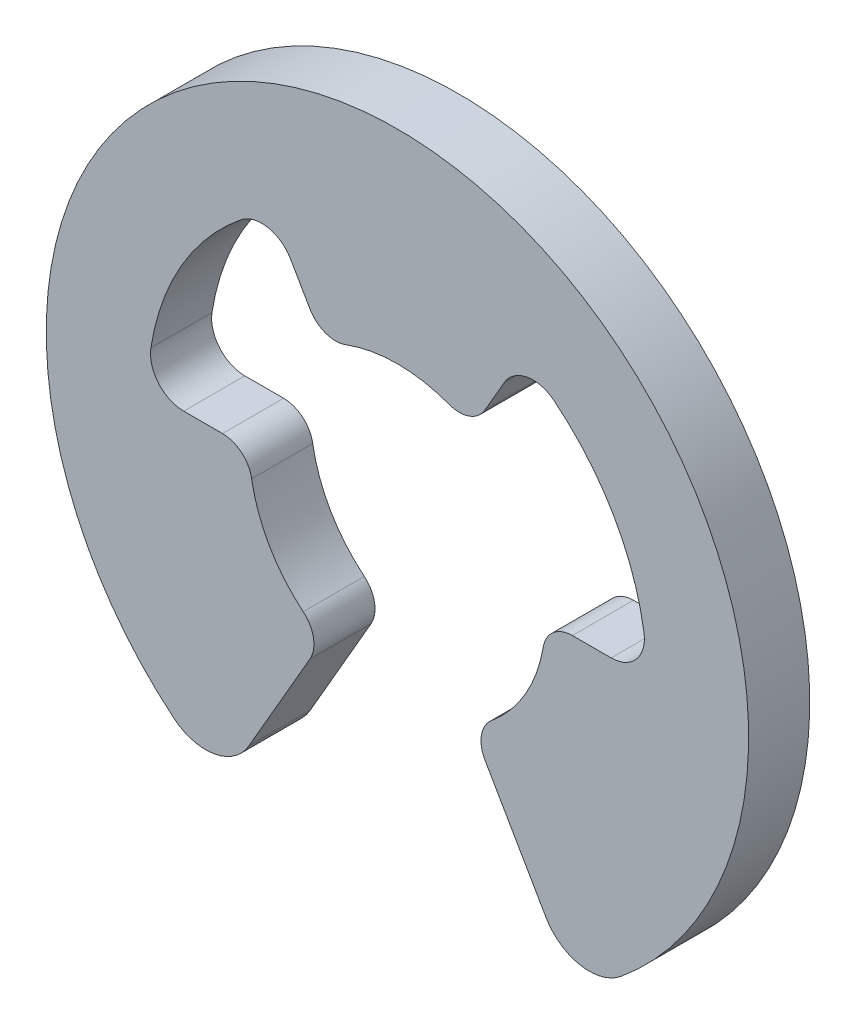
ISO-10303-21;
HEADER;
FILE_DESCRIPTION(('STEP AP214'),'2;1');
FILE_NAME('part.step','',(''),(''),'','','');
FILE_SCHEMA(('AUTOMOTIVE_DESIGN { 1 0 10303 214 1 1 1 1 }'));
ENDSEC;
DATA;
#1=APPLICATION_CONTEXT('core data for automotive mechanical design processes');
#2=APPLICATION_PROTOCOL_DEFINITION('international standard','automotive_design',2000,#1);
#3=PRODUCT_CONTEXT('',#1,'mechanical');
#4=PRODUCT('Part','Part','',(#3));
#5=PRODUCT_RELATED_PRODUCT_CATEGORY('part','',(#4));
#6=PRODUCT_DEFINITION_FORMATION('','',#4);
#7=PRODUCT_DEFINITION_CONTEXT('part definition',#1,'design');
#8=PRODUCT_DEFINITION('design','',#6,#7);
#9=PRODUCT_DEFINITION_SHAPE('','',#8);
#10=(LENGTH_UNIT() NAMED_UNIT(*) SI_UNIT(.MILLI.,.METRE.));
#11=(NAMED_UNIT(*) PLANE_ANGLE_UNIT() SI_UNIT($,.RADIAN.));
#12=(NAMED_UNIT(*) SI_UNIT($,.STERADIAN.) SOLID_ANGLE_UNIT());
#13=UNCERTAINTY_MEASURE_WITH_UNIT(LENGTH_MEASURE(1.E-05),#10,'distance_accuracy_value','');
#14=(GEOMETRIC_REPRESENTATION_CONTEXT(3) GLOBAL_UNCERTAINTY_ASSIGNED_CONTEXT((#13)) GLOBAL_UNIT_ASSIGNED_CONTEXT((#10,
#11,#12)) REPRESENTATION_CONTEXT('',''));
#15=CARTESIAN_POINT('',(0.,0.,0.));
#16=DIRECTION('',(0.,0.,1.));
#17=DIRECTION('',(1.,0.,0.));
#18=AXIS2_PLACEMENT_3D('',#15,#16,#17);
#19=CARTESIAN_POINT('',(3.46765265221274,-4.20148057663333,0.55245));
#20=DIRECTION('',(0.,0.,-1.));
#21=DIRECTION('',(-1.,0.,0.));
#22=AXIS2_PLACEMENT_3D('',#19,#20,#21);
#23=CYLINDRICAL_SURFACE('',#22,0.902334999999987);
#24=DIRECTION('',(0.,0.,-1.));
#25=VECTOR('',#24,1.);
#26=CARTESIAN_POINT('',(2.6862076194889,-4.6526480766333,0.55245));
#27=LINE('',#26,#25);
#28=CARTESIAN_POINT('',(2.6862076194889,-4.6526480766333,0.55245));
#29=VERTEX_POINT('',#28);
#30=CARTESIAN_POINT('',(2.6862076194889,-4.6526480766333,-0.55245));
#31=VERTEX_POINT('',#30);
#32=EDGE_CURVE('E212',#29,#31,#27,.T.);
#33=ORIENTED_EDGE('',*,*,#32,.T.);
#34=CARTESIAN_POINT('',(3.46765265221274,-4.20148057663333,-0.55245));
#35=DIRECTION('',(0.,0.,1.));
#36=DIRECTION('',(1.,0.,0.));
#37=AXIS2_PLACEMENT_3D('',#34,#35,#36);
#38=CIRCLE('',#37,0.902334999999987);
#39=CARTESIAN_POINT('',(4.0420243363657,-4.8974012766188,-0.55245));
#40=VERTEX_POINT('',#39);
#41=EDGE_CURVE('E206',#31,#40,#38,.T.);
#42=ORIENTED_EDGE('',*,*,#41,.T.);
#43=DIRECTION('',(0.,0.,-1.));
#44=VECTOR('',#43,1.);
#45=CARTESIAN_POINT('',(4.0420243363657,-4.8974012766188,0.55245));
#46=LINE('',#45,#44);
#47=CARTESIAN_POINT('',(4.0420243363657,-4.8974012766188,0.55245));
#48=VERTEX_POINT('',#47);
#49=EDGE_CURVE('E11',#48,#40,#46,.T.);
#50=ORIENTED_EDGE('',*,*,#49,.F.);
#51=CARTESIAN_POINT('',(3.46765265221274,-4.20148057663333,0.55245));
#52=DIRECTION('',(0.,0.,1.));
#53=DIRECTION('',(1.,0.,0.));
#54=AXIS2_PLACEMENT_3D('',#51,#52,#53);
#55=CIRCLE('',#54,0.902334999999987);
#56=EDGE_CURVE('E278',#29,#48,#55,.T.);
#57=ORIENTED_EDGE('',*,*,#56,.F.);
#58=EDGE_LOOP('',(#33,#42,#50,#57));
#59=FACE_BOUND('',#58,.T.);
#60=ADVANCED_FACE('F34',(#59),#23,.T.);
#61=CARTESIAN_POINT('',(0.,0.,0.55245));
#62=DIRECTION('',(0.,0.,-1.));
#63=DIRECTION('',(-1.,0.,0.));
#64=AXIS2_PLACEMENT_3D('',#61,#62,#63);
#65=CYLINDRICAL_SURFACE('',#64,6.35000000000001);
#66=ORIENTED_EDGE('',*,*,#49,.T.);
#67=CARTESIAN_POINT('',(0.,0.,-0.55245));
#68=DIRECTION('',(0.,0.,1.));
#69=DIRECTION('',(1.,0.,0.));
#70=AXIS2_PLACEMENT_3D('',#67,#68,#69);
#71=CIRCLE('',#70,6.35000000000001);
#72=CARTESIAN_POINT('',(-4.0420243061111,-4.8974013015892,-0.55245));
#73=VERTEX_POINT('',#72);
#74=EDGE_CURVE('E196',#40,#73,#71,.T.);
#75=ORIENTED_EDGE('',*,*,#74,.T.);
#76=DIRECTION('',(0.,0.,-1.));
#77=VECTOR('',#76,1.);
#78=CARTESIAN_POINT('',(-4.0420243061111,-4.8974013015892,0.55245));
#79=LINE('',#78,#77);
#80=CARTESIAN_POINT('',(-4.0420243061111,-4.8974013015892,0.55245));
#81=VERTEX_POINT('',#80);
#82=EDGE_CURVE('E41',#81,#73,#79,.T.);
#83=ORIENTED_EDGE('',*,*,#82,.F.);
#84=CARTESIAN_POINT('',(0.,0.,0.55245));
#85=DIRECTION('',(0.,0.,1.));
#86=DIRECTION('',(1.,0.,0.));
#87=AXIS2_PLACEMENT_3D('',#84,#85,#86);
#88=CIRCLE('',#87,6.35000000000001);
#89=EDGE_CURVE('E197',#48,#81,#88,.T.);
#90=ORIENTED_EDGE('',*,*,#89,.F.);
#91=EDGE_LOOP('',(#66,#75,#83,#90));
#92=FACE_BOUND('',#91,.T.);
#93=ADVANCED_FACE('F194',(#92),#65,.T.);
#94=CARTESIAN_POINT('',(-3.46765265221277,-4.20148057663329,0.55245));
#95=DIRECTION('',(0.,0.,-1.));
#96=DIRECTION('',(-1.,0.,0.));
#97=AXIS2_PLACEMENT_3D('',#94,#95,#96);
#98=CYLINDRICAL_SURFACE('',#97,0.90233500000004);
#99=ORIENTED_EDGE('',*,*,#82,.T.);
#100=CARTESIAN_POINT('',(-3.46765265221277,-4.20148057663329,-0.55245));
#101=DIRECTION('',(0.,0.,1.));
#102=DIRECTION('',(1.,0.,0.));
#103=AXIS2_PLACEMENT_3D('',#100,#101,#102);
#104=CIRCLE('',#103,0.90233500000004);
#105=CARTESIAN_POINT('',(-2.6862076194889,-4.6526480766333,-0.55245));
#106=VERTEX_POINT('',#105);
#107=EDGE_CURVE('E210',#73,#106,#104,.T.);
#108=ORIENTED_EDGE('',*,*,#107,.T.);
#109=DIRECTION('',(0.,0.,-1.));
#110=VECTOR('',#109,1.);
#111=CARTESIAN_POINT('',(-2.6862076194889,-4.6526480766333,0.55245));
#112=LINE('',#111,#110);
#113=CARTESIAN_POINT('',(-2.6862076194889,-4.6526480766333,0.55245));
#114=VERTEX_POINT('',#113);
#115=EDGE_CURVE('E364',#114,#106,#112,.T.);
#116=ORIENTED_EDGE('',*,*,#115,.F.);
#117=CARTESIAN_POINT('',(-3.46765265221277,-4.20148057663329,0.55245));
#118=DIRECTION('',(0.,0.,1.));
#119=DIRECTION('',(1.,0.,0.));
#120=AXIS2_PLACEMENT_3D('',#117,#118,#119);
#121=CIRCLE('',#120,0.90233500000004);
#122=EDGE_CURVE('E281',#81,#114,#121,.T.);
#123=ORIENTED_EDGE('',*,*,#122,.F.);
#124=EDGE_LOOP('',(#99,#108,#116,#123));
#125=FACE_BOUND('',#124,.T.);
#126=ADVANCED_FACE('F367',(#125),#98,.T.);
#127=CARTESIAN_POINT('',(-2.6862076194889,-4.6526480766333,0.55245));
#128=DIRECTION('',(-0.866025403784419,0.500000000000034,0.));
#129=DIRECTION('',(-0.500000000000034,-0.866025403784419,0.));
#130=AXIS2_PLACEMENT_3D('',#127,#128,#129);
#131=PLANE('',#130);
#132=ORIENTED_EDGE('',*,*,#115,.T.);
#133=DIRECTION('',(0.500000000000034,0.866025403784419,0.));
#134=VECTOR('',#133,1.);
#135=CARTESIAN_POINT('',(-2.6862076194889,-4.6526480766333,-0.55245));
#136=LINE('',#135,#134);
#137=CARTESIAN_POINT('',(-1.5815751888149,-2.7393685830178,-0.55245));
#138=VERTEX_POINT('',#137);
#139=EDGE_CURVE('E216',#106,#138,#136,.T.);
#140=ORIENTED_EDGE('',*,*,#139,.T.);
#141=DIRECTION('',(0.,0.,-1.));
#142=VECTOR('',#141,1.);
#143=CARTESIAN_POINT('',(-1.5815751888149,-2.7393685830178,0.55245));
#144=LINE('',#143,#142);
#145=CARTESIAN_POINT('',(-1.5815751888149,-2.7393685830178,0.55245));
#146=VERTEX_POINT('',#145);
#147=EDGE_CURVE('E362',#146,#138,#144,.T.);
#148=ORIENTED_EDGE('',*,*,#147,.F.);
#149=DIRECTION('',(0.500000000000034,0.866025403784419,0.));
#150=VECTOR('',#149,1.);
#151=CARTESIAN_POINT('',(-2.6862076194889,-4.6526480766333,0.55245));
#152=LINE('',#151,#150);
#153=EDGE_CURVE('E283',#114,#146,#152,.T.);
#154=ORIENTED_EDGE('',*,*,#153,.F.);
#155=EDGE_LOOP('',(#132,#140,#148,#154));
#156=FACE_BOUND('',#155,.T.);
#157=ADVANCED_FACE('F375',(#156),#131,.F.);
#158=CARTESIAN_POINT('',(-2.04461299145624,-2.47203358301781,0.55245));
#159=DIRECTION('',(0.,0.,-1.));
#160=DIRECTION('',(-1.,0.,0.));
#161=AXIS2_PLACEMENT_3D('',#158,#159,#160);
#162=CYLINDRICAL_SURFACE('',#161,0.534669999999918);
#163=ORIENTED_EDGE('',*,*,#147,.T.);
#164=CARTESIAN_POINT('',(-2.04461299145624,-2.47203358301781,-0.55245));
#165=DIRECTION('',(0.,0.,1.));
#166=DIRECTION('',(1.,0.,0.));
#167=AXIS2_PLACEMENT_3D('',#164,#165,#166);
#168=CIRCLE('',#167,0.534669999999918);
#169=CARTESIAN_POINT('',(-1.7038441516538,-2.0600279923766,-0.55245));
#170=VERTEX_POINT('',#169);
#171=EDGE_CURVE('E219',#138,#170,#168,.T.);
#172=ORIENTED_EDGE('',*,*,#171,.T.);
#173=DIRECTION('',(0.,0.,-1.));
#174=VECTOR('',#173,1.);
#175=CARTESIAN_POINT('',(-1.7038441516538,-2.0600279923766,0.55245));
#176=LINE('',#175,#174);
#177=CARTESIAN_POINT('',(-1.7038441516538,-2.0600279923766,0.55245));
#178=VERTEX_POINT('',#177);
#179=EDGE_CURVE('E360',#178,#170,#176,.T.);
#180=ORIENTED_EDGE('',*,*,#179,.F.);
#181=CARTESIAN_POINT('',(-2.04461299145624,-2.47203358301781,0.55245));
#182=DIRECTION('',(0.,0.,1.));
#183=DIRECTION('',(1.,0.,0.));
#184=AXIS2_PLACEMENT_3D('',#181,#182,#183);
#185=CIRCLE('',#184,0.534669999999918);
#186=EDGE_CURVE('E285',#146,#178,#185,.T.);
#187=ORIENTED_EDGE('',*,*,#186,.F.);
#188=EDGE_LOOP('',(#163,#172,#180,#187));
#189=FACE_BOUND('',#188,.T.);
#190=ADVANCED_FACE('F378',(#189),#162,.T.);
#191=CARTESIAN_POINT('',(0.,0.,0.55245));
#192=DIRECTION('',(0.,0.,-1.));
#193=DIRECTION('',(-1.,0.,0.));
#194=AXIS2_PLACEMENT_3D('',#191,#192,#193);
#195=CYLINDRICAL_SURFACE('',#194,2.67334999999996);
#196=ORIENTED_EDGE('',*,*,#179,.T.);
#197=CARTESIAN_POINT('',(0.,0.,-0.55245));
#198=DIRECTION('',(0.,0.,-1.));
#199=DIRECTION('',(-1.,0.,0.));
#200=AXIS2_PLACEMENT_3D('',#197,#198,#199);
#201=CIRCLE('',#200,2.67334999999996);
#202=CARTESIAN_POINT('',(-2.63595864244921,-0.445558366319483,-0.55245));
#203=VERTEX_POINT('',#202);
#204=EDGE_CURVE('E222',#170,#203,#201,.T.);
#205=ORIENTED_EDGE('',*,*,#204,.T.);
#206=DIRECTION('',(0.,0.,-1.));
#207=VECTOR('',#206,1.);
#208=CARTESIAN_POINT('',(-2.63595864244921,-0.445558366319483,0.55245));
#209=LINE('',#208,#207);
#210=CARTESIAN_POINT('',(-2.63595864244921,-0.445558366319483,0.55245));
#211=VERTEX_POINT('',#210);
#212=EDGE_CURVE('E358',#211,#203,#209,.T.);
#213=ORIENTED_EDGE('',*,*,#212,.F.);
#214=CARTESIAN_POINT('',(0.,0.,0.55245));
#215=DIRECTION('',(0.,0.,-1.));
#216=DIRECTION('',(-1.,0.,0.));
#217=AXIS2_PLACEMENT_3D('',#214,#215,#216);
#218=CIRCLE('',#217,2.67334999999996);
#219=EDGE_CURVE('E287',#178,#211,#218,.T.);
#220=ORIENTED_EDGE('',*,*,#219,.F.);
#221=EDGE_LOOP('',(#196,#205,#213,#220));
#222=FACE_BOUND('',#221,.T.);
#223=ADVANCED_FACE('F383',(#222),#195,.F.);
#224=CARTESIAN_POINT('',(-3.16315037762992,-0.534670000000077,0.55245));
#225=DIRECTION('',(0.,0.,-1.));
#226=DIRECTION('',(-1.,0.,0.));
#227=AXIS2_PLACEMENT_3D('',#224,#225,#226);
#228=CYLINDRICAL_SURFACE('',#227,0.534670000000077);
#229=ORIENTED_EDGE('',*,*,#212,.T.);
#230=CARTESIAN_POINT('',(-3.16315037762992,-0.534670000000077,-0.55245));
#231=DIRECTION('',(0.,0.,1.));
#232=DIRECTION('',(1.,0.,0.));
#233=AXIS2_PLACEMENT_3D('',#230,#231,#232);
#234=CIRCLE('',#233,0.534670000000077);
#235=CARTESIAN_POINT('',(-3.1631503776299,0.,-0.55245));
#236=VERTEX_POINT('',#235);
#237=EDGE_CURVE('E225',#203,#236,#234,.T.);
#238=ORIENTED_EDGE('',*,*,#237,.T.);
#239=DIRECTION('',(0.,0.,-1.));
#240=VECTOR('',#239,1.);
#241=CARTESIAN_POINT('',(-3.1631503776299,0.,0.55245));
#242=LINE('',#241,#240);
#243=CARTESIAN_POINT('',(-3.1631503776299,0.,0.55245));
#244=VERTEX_POINT('',#243);
#245=EDGE_CURVE('E356',#244,#236,#242,.T.);
#246=ORIENTED_EDGE('',*,*,#245,.F.);
#247=CARTESIAN_POINT('',(-3.16315037762992,-0.534670000000077,0.55245));
#248=DIRECTION('',(0.,0.,1.));
#249=DIRECTION('',(1.,0.,0.));
#250=AXIS2_PLACEMENT_3D('',#247,#248,#249);
#251=CIRCLE('',#250,0.534670000000077);
#252=EDGE_CURVE('E289',#211,#244,#251,.T.);
#253=ORIENTED_EDGE('',*,*,#252,.F.);
#254=EDGE_LOOP('',(#229,#238,#246,#253));
#255=FACE_BOUND('',#254,.T.);
#256=ADVANCED_FACE('F389',(#255),#228,.T.);
#257=CARTESIAN_POINT('',(-3.1631503776299,0.,0.55245));
#258=DIRECTION('',(0.,-1.,0.));
#259=DIRECTION('',(0.,0.,-1.));
#260=AXIS2_PLACEMENT_3D('',#257,#258,#259);
#261=PLANE('',#260);
#262=ORIENTED_EDGE('',*,*,#245,.T.);
#263=DIRECTION('',(-1.,0.,0.));
#264=VECTOR('',#263,1.);
#265=CARTESIAN_POINT('',(-3.1631503776299,0.,-0.55245));
#266=LINE('',#265,#264);
#267=CARTESIAN_POINT('',(-3.8635676462899,0.,-0.55245));
#268=VERTEX_POINT('',#267);
#269=EDGE_CURVE('E228',#236,#268,#266,.T.);
#270=ORIENTED_EDGE('',*,*,#269,.T.);
#271=DIRECTION('',(0.,0.,-1.));
#272=VECTOR('',#271,1.);
#273=CARTESIAN_POINT('',(-3.8635676462899,0.,0.55245));
#274=LINE('',#273,#272);
#275=CARTESIAN_POINT('',(-3.8635676462899,0.,0.55245));
#276=VERTEX_POINT('',#275);
#277=EDGE_CURVE('E354',#276,#268,#274,.T.);
#278=ORIENTED_EDGE('',*,*,#277,.F.);
#279=DIRECTION('',(-1.,0.,0.));
#280=VECTOR('',#279,1.);
#281=CARTESIAN_POINT('',(-3.1631503776299,0.,0.55245));
#282=LINE('',#281,#280);
#283=EDGE_CURVE('E291',#244,#276,#282,.T.);
#284=ORIENTED_EDGE('',*,*,#283,.F.);
#285=EDGE_LOOP('',(#262,#270,#278,#284));
#286=FACE_BOUND('',#285,.T.);
#287=ADVANCED_FACE('F393',(#286),#261,.F.);
#288=CARTESIAN_POINT('',(-3.86356764629,0.601556666666609,0.55245));
#289=DIRECTION('',(0.,0.,-1.));
#290=DIRECTION('',(-1.,0.,0.));
#291=AXIS2_PLACEMENT_3D('',#288,#289,#290);
#292=CYLINDRICAL_SURFACE('',#291,0.601556666666609);
#293=ORIENTED_EDGE('',*,*,#277,.T.);
#294=CARTESIAN_POINT('',(-3.86356764629,0.601556666666609,-0.55245));
#295=DIRECTION('',(0.,0.,-1.));
#296=DIRECTION('',(-1.,0.,0.));
#297=AXIS2_PLACEMENT_3D('',#294,#295,#296);
#298=CIRCLE('',#297,0.601556666666609);
#299=CARTESIAN_POINT('',(-4.4579626710247,0.69410383184027,-0.55245));
#300=VERTEX_POINT('',#299);
#301=EDGE_CURVE('E231',#268,#300,#298,.T.);
#302=ORIENTED_EDGE('',*,*,#301,.T.);
#303=DIRECTION('',(0.,0.,-1.));
#304=VECTOR('',#303,1.);
#305=CARTESIAN_POINT('',(-4.4579626710247,0.69410383184027,0.55245));
#306=LINE('',#305,#304);
#307=CARTESIAN_POINT('',(-4.4579626710247,0.69410383184027,0.55245));
#308=VERTEX_POINT('',#307);
#309=EDGE_CURVE('E352',#308,#300,#306,.T.);
#310=ORIENTED_EDGE('',*,*,#309,.F.);
#311=CARTESIAN_POINT('',(-3.86356764629,0.601556666666609,0.55245));
#312=DIRECTION('',(0.,0.,-1.));
#313=DIRECTION('',(-1.,0.,0.));
#314=AXIS2_PLACEMENT_3D('',#311,#312,#313);
#315=CIRCLE('',#314,0.601556666666609);
#316=EDGE_CURVE('E293',#276,#308,#315,.T.);
#317=ORIENTED_EDGE('',*,*,#316,.F.);
#318=EDGE_LOOP('',(#293,#302,#310,#317));
#319=FACE_BOUND('',#318,.T.);
#320=ADVANCED_FACE('F398',(#319),#292,.F.);
#321=CARTESIAN_POINT('',(0.,0.,0.55245));
#322=DIRECTION('',(0.,0.,-1.));
#323=DIRECTION('',(-1.,0.,0.));
#324=AXIS2_PLACEMENT_3D('',#321,#322,#323);
#325=CYLINDRICAL_SURFACE('',#324,4.51167500000002);
#326=ORIENTED_EDGE('',*,*,#309,.T.);
#327=CARTESIAN_POINT('',(0.,0.,-0.55245));
#328=DIRECTION('',(0.,0.,-1.));
#329=DIRECTION('',(-1.,0.,0.));
#330=AXIS2_PLACEMENT_3D('',#327,#328,#329);
#331=CIRCLE('',#330,4.51167500000002);
#332=CARTESIAN_POINT('',(-2.83009289803178,3.51365699722317,-0.55245));
#333=VERTEX_POINT('',#332);
#334=EDGE_CURVE('E234',#300,#333,#331,.T.);
#335=ORIENTED_EDGE('',*,*,#334,.T.);
#336=DIRECTION('',(0.,0.,-1.));
#337=VECTOR('',#336,1.);
#338=CARTESIAN_POINT('',(-2.83009289803178,3.51365699722317,0.55245));
#339=LINE('',#338,#337);
#340=CARTESIAN_POINT('',(-2.83009289803178,3.51365699722317,0.55245));
#341=VERTEX_POINT('',#340);
#342=EDGE_CURVE('E350',#341,#333,#339,.T.);
#343=ORIENTED_EDGE('',*,*,#342,.F.);
#344=CARTESIAN_POINT('',(0.,0.,0.55245));
#345=DIRECTION('',(0.,0.,-1.));
#346=DIRECTION('',(-1.,0.,0.));
#347=AXIS2_PLACEMENT_3D('',#344,#345,#346);
#348=CIRCLE('',#347,4.51167500000002);
#349=EDGE_CURVE('E295',#308,#341,#348,.T.);
#350=ORIENTED_EDGE('',*,*,#349,.F.);
#351=EDGE_LOOP('',(#326,#335,#343,#350));
#352=FACE_BOUND('',#351,.T.);
#353=ADVANCED_FACE('F404',(#352),#325,.F.);
#354=CARTESIAN_POINT('',(-2.45274717829428,3.04516939759328,0.55245));
#355=DIRECTION('',(0.,0.,-1.));
#356=DIRECTION('',(-1.,0.,0.));
#357=AXIS2_PLACEMENT_3D('',#354,#355,#356);
#358=CYLINDRICAL_SURFACE('',#357,0.601556666666766);
#359=ORIENTED_EDGE('',*,*,#342,.T.);
#360=CARTESIAN_POINT('',(-2.45274717829428,3.04516939759328,-0.55245));
#361=DIRECTION('',(0.,0.,-1.));
#362=DIRECTION('',(-1.,0.,0.));
#363=AXIS2_PLACEMENT_3D('',#360,#361,#362);
#364=CIRCLE('',#363,0.601556666666766);
#365=CARTESIAN_POINT('',(-1.931783823145,3.3459477309267,-0.55245));
#366=VERTEX_POINT('',#365);
#367=EDGE_CURVE('E237',#333,#366,#364,.T.);
#368=ORIENTED_EDGE('',*,*,#367,.T.);
#369=DIRECTION('',(0.,0.,-1.));
#370=VECTOR('',#369,1.);
#371=CARTESIAN_POINT('',(-1.931783823145,3.3459477309267,0.55245));
#372=LINE('',#371,#370);
#373=CARTESIAN_POINT('',(-1.931783823145,3.3459477309267,0.55245));
#374=VERTEX_POINT('',#373);
#375=EDGE_CURVE('E348',#374,#366,#372,.T.);
#376=ORIENTED_EDGE('',*,*,#375,.F.);
#377=CARTESIAN_POINT('',(-2.45274717829428,3.04516939759328,0.55245));
#378=DIRECTION('',(0.,0.,-1.));
#379=DIRECTION('',(-1.,0.,0.));
#380=AXIS2_PLACEMENT_3D('',#377,#378,#379);
#381=CIRCLE('',#380,0.601556666666766);
#382=EDGE_CURVE('E297',#341,#374,#381,.T.);
#383=ORIENTED_EDGE('',*,*,#382,.F.);
#384=EDGE_LOOP('',(#359,#368,#376,#383));
#385=FACE_BOUND('',#384,.T.);
#386=ADVANCED_FACE('F408',(#385),#358,.F.);
#387=CARTESIAN_POINT('',(-1.931783823145,3.3459477309267,0.55245));
#388=DIRECTION('',(0.866025403784387,0.500000000000089,0.));
#389=DIRECTION('',(-0.500000000000089,0.866025403784387,0.));
#390=AXIS2_PLACEMENT_3D('',#387,#388,#389);
#391=PLANE('',#390);
#392=ORIENTED_EDGE('',*,*,#375,.T.);
#393=DIRECTION('',(0.500000000000089,-0.866025403784387,0.));
#394=VECTOR('',#393,1.);
#395=CARTESIAN_POINT('',(-1.931783823145,3.3459477309267,-0.55245));
#396=LINE('',#395,#394);
#397=CARTESIAN_POINT('',(-1.5815751888149,2.7393685830178,-0.55245));
#398=VERTEX_POINT('',#397);
#399=EDGE_CURVE('E240',#366,#398,#396,.T.);
#400=ORIENTED_EDGE('',*,*,#399,.T.);
#401=DIRECTION('',(0.,0.,-1.));
#402=VECTOR('',#401,1.);
#403=CARTESIAN_POINT('',(-1.5815751888149,2.7393685830178,0.55245));
#404=LINE('',#403,#402);
#405=CARTESIAN_POINT('',(-1.5815751888149,2.7393685830178,0.55245));
#406=VERTEX_POINT('',#405);
#407=EDGE_CURVE('E346',#406,#398,#404,.T.);
#408=ORIENTED_EDGE('',*,*,#407,.F.);
#409=DIRECTION('',(0.500000000000089,-0.866025403784387,0.));
#410=VECTOR('',#409,1.);
#411=CARTESIAN_POINT('',(-1.931783823145,3.3459477309267,0.55245));
#412=LINE('',#411,#410);
#413=EDGE_CURVE('E299',#374,#406,#412,.T.);
#414=ORIENTED_EDGE('',*,*,#413,.F.);
#415=EDGE_LOOP('',(#392,#400,#408,#414));
#416=FACE_BOUND('',#415,.T.);
#417=ADVANCED_FACE('F413',(#416),#391,.F.);
#418=CARTESIAN_POINT('',(-1.1185373861735,3.00670358301775,0.55245));
#419=DIRECTION('',(0.,0.,-1.));
#420=DIRECTION('',(-1.,0.,0.));
#421=AXIS2_PLACEMENT_3D('',#418,#419,#420);
#422=CYLINDRICAL_SURFACE('',#421,0.534669999999951);
#423=ORIENTED_EDGE('',*,*,#407,.T.);
#424=CARTESIAN_POINT('',(-1.1185373861735,3.00670358301775,-0.55245));
#425=DIRECTION('',(0.,0.,1.));
#426=DIRECTION('',(1.,0.,0.));
#427=AXIS2_PLACEMENT_3D('',#424,#425,#426);
#428=CIRCLE('',#427,0.534669999999951);
#429=CARTESIAN_POINT('',(-0.93211448847792,2.5055863191815,-0.55245));
#430=VERTEX_POINT('',#429);
#431=EDGE_CURVE('E243',#398,#430,#428,.T.);
#432=ORIENTED_EDGE('',*,*,#431,.T.);
#433=DIRECTION('',(0.,0.,-1.));
#434=VECTOR('',#433,1.);
#435=CARTESIAN_POINT('',(-0.93211448847792,2.5055863191815,0.55245));
#436=LINE('',#435,#434);
#437=CARTESIAN_POINT('',(-0.93211448847792,2.5055863191815,0.55245));
#438=VERTEX_POINT('',#437);
#439=EDGE_CURVE('E344',#438,#430,#436,.T.);
#440=ORIENTED_EDGE('',*,*,#439,.F.);
#441=CARTESIAN_POINT('',(-1.1185373861735,3.00670358301775,0.55245));
#442=DIRECTION('',(0.,0.,1.));
#443=DIRECTION('',(1.,0.,0.));
#444=AXIS2_PLACEMENT_3D('',#441,#442,#443);
#445=CIRCLE('',#444,0.534669999999951);
#446=EDGE_CURVE('E301',#406,#438,#445,.T.);
#447=ORIENTED_EDGE('',*,*,#446,.F.);
#448=EDGE_LOOP('',(#423,#432,#440,#447));
#449=FACE_BOUND('',#448,.T.);
#450=ADVANCED_FACE('F419',(#449),#422,.T.);
#451=CARTESIAN_POINT('',(0.,0.,0.55245));
#452=DIRECTION('',(0.,0.,-1.));
#453=DIRECTION('',(-1.,0.,0.));
#454=AXIS2_PLACEMENT_3D('',#451,#452,#453);
#455=CYLINDRICAL_SURFACE('',#454,2.67335);
#456=ORIENTED_EDGE('',*,*,#439,.T.);
#457=CARTESIAN_POINT('',(0.,0.,-0.55245));
#458=DIRECTION('',(0.,0.,-1.));
#459=DIRECTION('',(-1.,0.,0.));
#460=AXIS2_PLACEMENT_3D('',#457,#458,#459);
#461=CIRCLE('',#460,2.67335);
#462=CARTESIAN_POINT('',(0.932114457123236,2.50558633084589,-0.55245));
#463=VERTEX_POINT('',#462);
#464=EDGE_CURVE('E246',#430,#463,#461,.T.);
#465=ORIENTED_EDGE('',*,*,#464,.T.);
#466=DIRECTION('',(0.,0.,-1.));
#467=VECTOR('',#466,1.);
#468=CARTESIAN_POINT('',(0.932114457123236,2.50558633084589,0.55245));
#469=LINE('',#468,#467);
#470=CARTESIAN_POINT('',(0.932114457123236,2.50558633084589,0.55245));
#471=VERTEX_POINT('',#470);
#472=EDGE_CURVE('E342',#471,#463,#469,.T.);
#473=ORIENTED_EDGE('',*,*,#472,.F.);
#474=CARTESIAN_POINT('',(0.,0.,0.55245));
#475=DIRECTION('',(0.,0.,-1.));
#476=DIRECTION('',(-1.,0.,0.));
#477=AXIS2_PLACEMENT_3D('',#474,#475,#476);
#478=CIRCLE('',#477,2.67335);
#479=EDGE_CURVE('E303',#438,#471,#478,.T.);
#480=ORIENTED_EDGE('',*,*,#479,.F.);
#481=EDGE_LOOP('',(#456,#465,#473,#480));
#482=FACE_BOUND('',#481,.T.);
#483=ADVANCED_FACE('F423',(#482),#455,.F.);
#484=CARTESIAN_POINT('',(1.11853738617351,3.00670358301775,0.55245));
#485=DIRECTION('',(0.,0.,-1.));
#486=DIRECTION('',(-1.,0.,0.));
#487=AXIS2_PLACEMENT_3D('',#484,#485,#486);
#488=CYLINDRICAL_SURFACE('',#487,0.534669999999946);
#489=ORIENTED_EDGE('',*,*,#472,.T.);
#490=CARTESIAN_POINT('',(1.11853738617351,3.00670358301775,-0.55245));
#491=DIRECTION('',(0.,0.,1.));
#492=DIRECTION('',(1.,0.,0.));
#493=AXIS2_PLACEMENT_3D('',#490,#491,#492);
#494=CIRCLE('',#493,0.534669999999946);
#495=CARTESIAN_POINT('',(1.5815751888149,2.7393685830178,-0.55245));
#496=VERTEX_POINT('',#495);
#497=EDGE_CURVE('E249',#463,#496,#494,.T.);
#498=ORIENTED_EDGE('',*,*,#497,.T.);
#499=DIRECTION('',(0.,0.,-1.));
#500=VECTOR('',#499,1.);
#501=CARTESIAN_POINT('',(1.5815751888149,2.7393685830178,0.55245));
#502=LINE('',#501,#500);
#503=CARTESIAN_POINT('',(1.5815751888149,2.7393685830178,0.55245));
#504=VERTEX_POINT('',#503);
#505=EDGE_CURVE('E340',#504,#496,#502,.T.);
#506=ORIENTED_EDGE('',*,*,#505,.F.);
#507=CARTESIAN_POINT('',(1.11853738617351,3.00670358301775,0.55245));
#508=DIRECTION('',(0.,0.,1.));
#509=DIRECTION('',(1.,0.,0.));
#510=AXIS2_PLACEMENT_3D('',#507,#508,#509);
#511=CIRCLE('',#510,0.534669999999946);
#512=EDGE_CURVE('E305',#471,#504,#511,.T.);
#513=ORIENTED_EDGE('',*,*,#512,.F.);
#514=EDGE_LOOP('',(#489,#498,#506,#513));
#515=FACE_BOUND('',#514,.T.);
#516=ADVANCED_FACE('F428',(#515),#488,.T.);
#517=CARTESIAN_POINT('',(1.5815751888149,2.7393685830178,0.55245));
#518=DIRECTION('',(-0.866025403784387,0.500000000000089,0.));
#519=DIRECTION('',(-0.500000000000089,-0.866025403784387,0.));
#520=AXIS2_PLACEMENT_3D('',#517,#518,#519);
#521=PLANE('',#520);
#522=ORIENTED_EDGE('',*,*,#505,.T.);
#523=DIRECTION('',(0.500000000000089,0.866025403784387,0.));
#524=VECTOR('',#523,1.);
#525=CARTESIAN_POINT('',(1.5815751888149,2.7393685830178,-0.55245));
#526=LINE('',#525,#524);
#527=CARTESIAN_POINT('',(1.931783823145,3.3459477309267,-0.55245));
#528=VERTEX_POINT('',#527);
#529=EDGE_CURVE('E252',#496,#528,#526,.T.);
#530=ORIENTED_EDGE('',*,*,#529,.T.);
#531=DIRECTION('',(0.,0.,-1.));
#532=VECTOR('',#531,1.);
#533=CARTESIAN_POINT('',(1.931783823145,3.3459477309267,0.55245));
#534=LINE('',#533,#532);
#535=CARTESIAN_POINT('',(1.931783823145,3.3459477309267,0.55245));
#536=VERTEX_POINT('',#535);
#537=EDGE_CURVE('E338',#536,#528,#534,.T.);
#538=ORIENTED_EDGE('',*,*,#537,.F.);
#539=DIRECTION('',(0.500000000000089,0.866025403784387,0.));
#540=VECTOR('',#539,1.);
#541=CARTESIAN_POINT('',(1.5815751888149,2.7393685830178,0.55245));
#542=LINE('',#541,#540);
#543=EDGE_CURVE('E307',#504,#536,#542,.T.);
#544=ORIENTED_EDGE('',*,*,#543,.F.);
#545=EDGE_LOOP('',(#522,#530,#538,#544));
#546=FACE_BOUND('',#545,.T.);
#547=ADVANCED_FACE('F434',(#546),#521,.F.);
#548=CARTESIAN_POINT('',(2.45274717829425,3.04516939759332,0.55245));
#549=DIRECTION('',(0.,0.,-1.));
#550=DIRECTION('',(-1.,0.,0.));
#551=AXIS2_PLACEMENT_3D('',#548,#549,#550);
#552=CYLINDRICAL_SURFACE('',#551,0.601556666666717);
#553=ORIENTED_EDGE('',*,*,#537,.T.);
#554=CARTESIAN_POINT('',(2.45274717829425,3.04516939759332,-0.55245));
#555=DIRECTION('',(0.,0.,-1.));
#556=DIRECTION('',(-1.,0.,0.));
#557=AXIS2_PLACEMENT_3D('',#554,#555,#556);
#558=CIRCLE('',#557,0.601556666666717);
#559=CARTESIAN_POINT('',(2.8300929312439,3.5136569704723,-0.55245));
#560=VERTEX_POINT('',#559);
#561=EDGE_CURVE('E255',#528,#560,#558,.T.);
#562=ORIENTED_EDGE('',*,*,#561,.T.);
#563=DIRECTION('',(0.,0.,-1.));
#564=VECTOR('',#563,1.);
#565=CARTESIAN_POINT('',(2.8300929312439,3.5136569704723,0.55245));
#566=LINE('',#565,#564);
#567=CARTESIAN_POINT('',(2.8300929312439,3.5136569704723,0.55245));
#568=VERTEX_POINT('',#567);
#569=EDGE_CURVE('E336',#568,#560,#566,.T.);
#570=ORIENTED_EDGE('',*,*,#569,.F.);
#571=CARTESIAN_POINT('',(2.45274717829425,3.04516939759332,0.55245));
#572=DIRECTION('',(0.,0.,-1.));
#573=DIRECTION('',(-1.,0.,0.));
#574=AXIS2_PLACEMENT_3D('',#571,#572,#573);
#575=CIRCLE('',#574,0.601556666666717);
#576=EDGE_CURVE('E309',#536,#568,#575,.T.);
#577=ORIENTED_EDGE('',*,*,#576,.F.);
#578=EDGE_LOOP('',(#553,#562,#570,#577));
#579=FACE_BOUND('',#578,.T.);
#580=ADVANCED_FACE('F438',(#579),#552,.F.);
#581=CARTESIAN_POINT('',(0.,0.,0.55245));
#582=DIRECTION('',(0.,0.,-1.));
#583=DIRECTION('',(-1.,0.,0.));
#584=AXIS2_PLACEMENT_3D('',#581,#582,#583);
#585=CYLINDRICAL_SURFACE('',#584,4.51167500000006);
#586=ORIENTED_EDGE('',*,*,#569,.T.);
#587=CARTESIAN_POINT('',(0.,0.,-0.55245));
#588=DIRECTION('',(0.,0.,-1.));
#589=DIRECTION('',(-1.,0.,0.));
#590=AXIS2_PLACEMENT_3D('',#587,#588,#589);
#591=CIRCLE('',#590,4.51167500000006);
#592=CARTESIAN_POINT('',(4.4579626687961,0.694103846153851,-0.55245));
#593=VERTEX_POINT('',#592);
#594=EDGE_CURVE('E258',#560,#593,#591,.T.);
#595=ORIENTED_EDGE('',*,*,#594,.T.);
#596=DIRECTION('',(0.,0.,-1.));
#597=VECTOR('',#596,1.);
#598=CARTESIAN_POINT('',(4.4579626687961,0.694103846153851,0.55245));
#599=LINE('',#598,#597);
#600=CARTESIAN_POINT('',(4.4579626687961,0.694103846153851,0.55245));
#601=VERTEX_POINT('',#600);
#602=EDGE_CURVE('E334',#601,#593,#599,.T.);
#603=ORIENTED_EDGE('',*,*,#602,.F.);
#604=CARTESIAN_POINT('',(0.,0.,0.55245));
#605=DIRECTION('',(0.,0.,-1.));
#606=DIRECTION('',(-1.,0.,0.));
#607=AXIS2_PLACEMENT_3D('',#604,#605,#606);
#608=CIRCLE('',#607,4.51167500000006);
#609=EDGE_CURVE('E311',#568,#601,#608,.T.);
#610=ORIENTED_EDGE('',*,*,#609,.F.);
#611=EDGE_LOOP('',(#586,#595,#603,#610));
#612=FACE_BOUND('',#611,.T.);
#613=ADVANCED_FACE('F443',(#612),#585,.F.);
#614=CARTESIAN_POINT('',(3.86356764628999,0.601556666666637,0.55245));
#615=DIRECTION('',(0.,0.,-1.));
#616=DIRECTION('',(-1.,0.,0.));
#617=AXIS2_PLACEMENT_3D('',#614,#615,#616);
#618=CYLINDRICAL_SURFACE('',#617,0.601556666666637);
#619=ORIENTED_EDGE('',*,*,#602,.T.);
#620=CARTESIAN_POINT('',(3.86356764628999,0.601556666666637,-0.55245));
#621=DIRECTION('',(0.,0.,-1.));
#622=DIRECTION('',(-1.,0.,0.));
#623=AXIS2_PLACEMENT_3D('',#620,#621,#622);
#624=CIRCLE('',#623,0.601556666666637);
#625=CARTESIAN_POINT('',(3.8635676462899,0.,-0.55245));
#626=VERTEX_POINT('',#625);
#627=EDGE_CURVE('E261',#593,#626,#624,.T.);
#628=ORIENTED_EDGE('',*,*,#627,.T.);
#629=DIRECTION('',(0.,0.,-1.));
#630=VECTOR('',#629,1.);
#631=CARTESIAN_POINT('',(3.8635676462899,0.,0.55245));
#632=LINE('',#631,#630);
#633=CARTESIAN_POINT('',(3.8635676462899,0.,0.55245));
#634=VERTEX_POINT('',#633);
#635=EDGE_CURVE('E332',#634,#626,#632,.T.);
#636=ORIENTED_EDGE('',*,*,#635,.F.);
#637=CARTESIAN_POINT('',(3.86356764628999,0.601556666666637,0.55245));
#638=DIRECTION('',(0.,0.,-1.));
#639=DIRECTION('',(-1.,0.,0.));
#640=AXIS2_PLACEMENT_3D('',#637,#638,#639);
#641=CIRCLE('',#640,0.601556666666637);
#642=EDGE_CURVE('E313',#601,#634,#641,.T.);
#643=ORIENTED_EDGE('',*,*,#642,.F.);
#644=EDGE_LOOP('',(#619,#628,#636,#643));
#645=FACE_BOUND('',#644,.T.);
#646=ADVANCED_FACE('F449',(#645),#618,.F.);
#647=CARTESIAN_POINT('',(3.8635676462899,0.,0.55245));
#648=DIRECTION('',(0.,-1.,0.));
#649=DIRECTION('',(0.,0.,-1.));
#650=AXIS2_PLACEMENT_3D('',#647,#648,#649);
#651=PLANE('',#650);
#652=ORIENTED_EDGE('',*,*,#635,.T.);
#653=DIRECTION('',(-1.,0.,0.));
#654=VECTOR('',#653,1.);
#655=CARTESIAN_POINT('',(3.8635676462899,0.,-0.55245));
#656=LINE('',#655,#654);
#657=CARTESIAN_POINT('',(3.1631503776299,0.,-0.55245));
#658=VERTEX_POINT('',#657);
#659=EDGE_CURVE('E264',#626,#658,#656,.T.);
#660=ORIENTED_EDGE('',*,*,#659,.T.);
#661=DIRECTION('',(0.,0.,-1.));
#662=VECTOR('',#661,1.);
#663=CARTESIAN_POINT('',(3.1631503776299,0.,0.55245));
#664=LINE('',#663,#662);
#665=CARTESIAN_POINT('',(3.1631503776299,0.,0.55245));
#666=VERTEX_POINT('',#665);
#667=EDGE_CURVE('E330',#666,#658,#664,.T.);
#668=ORIENTED_EDGE('',*,*,#667,.F.);
#669=DIRECTION('',(-1.,0.,0.));
#670=VECTOR('',#669,1.);
#671=CARTESIAN_POINT('',(3.8635676462899,0.,0.55245));
#672=LINE('',#671,#670);
#673=EDGE_CURVE('E315',#634,#666,#672,.T.);
#674=ORIENTED_EDGE('',*,*,#673,.F.);
#675=EDGE_LOOP('',(#652,#660,#668,#674));
#676=FACE_BOUND('',#675,.T.);
#677=ADVANCED_FACE('F453',(#676),#651,.F.);
#678=CARTESIAN_POINT('',(3.1631503776299,-0.534670000000035,0.55245));
#679=DIRECTION('',(0.,0.,-1.));
#680=DIRECTION('',(-1.,0.,0.));
#681=AXIS2_PLACEMENT_3D('',#678,#679,#680);
#682=CYLINDRICAL_SURFACE('',#681,0.534670000000035);
#683=ORIENTED_EDGE('',*,*,#667,.T.);
#684=CARTESIAN_POINT('',(3.1631503776299,-0.534670000000035,-0.55245));
#685=DIRECTION('',(0.,0.,1.));
#686=DIRECTION('',(1.,0.,0.));
#687=AXIS2_PLACEMENT_3D('',#684,#685,#686);
#688=CIRCLE('',#687,0.534670000000035);
#689=CARTESIAN_POINT('',(2.6359586463177,-0.44555834343324,-0.55245));
#690=VERTEX_POINT('',#689);
#691=EDGE_CURVE('E267',#658,#690,#688,.T.);
#692=ORIENTED_EDGE('',*,*,#691,.T.);
#693=DIRECTION('',(0.,0.,-1.));
#694=VECTOR('',#693,1.);
#695=CARTESIAN_POINT('',(2.6359586463177,-0.44555834343324,0.55245));
#696=LINE('',#695,#694);
#697=CARTESIAN_POINT('',(2.6359586463177,-0.44555834343324,0.55245));
#698=VERTEX_POINT('',#697);
#699=EDGE_CURVE('E328',#698,#690,#696,.T.);
#700=ORIENTED_EDGE('',*,*,#699,.F.);
#701=CARTESIAN_POINT('',(3.1631503776299,-0.534670000000035,0.55245));
#702=DIRECTION('',(0.,0.,1.));
#703=DIRECTION('',(1.,0.,0.));
#704=AXIS2_PLACEMENT_3D('',#701,#702,#703);
#705=CIRCLE('',#704,0.534670000000035);
#706=EDGE_CURVE('E317',#666,#698,#705,.T.);
#707=ORIENTED_EDGE('',*,*,#706,.F.);
#708=EDGE_LOOP('',(#683,#692,#700,#707));
#709=FACE_BOUND('',#708,.T.);
#710=ADVANCED_FACE('F458',(#709),#682,.T.);
#711=CARTESIAN_POINT('',(0.,0.,0.55245));
#712=DIRECTION('',(0.,0.,-1.));
#713=DIRECTION('',(-1.,0.,0.));
#714=AXIS2_PLACEMENT_3D('',#711,#712,#713);
#715=CYLINDRICAL_SURFACE('',#714,2.67335000000002);
#716=ORIENTED_EDGE('',*,*,#699,.T.);
#717=CARTESIAN_POINT('',(0.,0.,-0.55245));
#718=DIRECTION('',(0.,0.,-1.));
#719=DIRECTION('',(-1.,0.,0.));
#720=AXIS2_PLACEMENT_3D('',#717,#718,#719);
#721=CIRCLE('',#720,2.67335000000002);
#722=CARTESIAN_POINT('',(1.70384418532601,-2.06002796452641,-0.55245));
#723=VERTEX_POINT('',#722);
#724=EDGE_CURVE('E270',#690,#723,#721,.T.);
#725=ORIENTED_EDGE('',*,*,#724,.T.);
#726=DIRECTION('',(0.,0.,-1.));
#727=VECTOR('',#726,1.);
#728=CARTESIAN_POINT('',(1.70384418532601,-2.06002796452641,0.55245));
#729=LINE('',#728,#727);
#730=CARTESIAN_POINT('',(1.70384418532601,-2.06002796452641,0.55245));
#731=VERTEX_POINT('',#730);
#732=EDGE_CURVE('E326',#731,#723,#729,.T.);
#733=ORIENTED_EDGE('',*,*,#732,.F.);
#734=CARTESIAN_POINT('',(0.,0.,0.55245));
#735=DIRECTION('',(0.,0.,-1.));
#736=DIRECTION('',(-1.,0.,0.));
#737=AXIS2_PLACEMENT_3D('',#734,#735,#736);
#738=CIRCLE('',#737,2.67335000000002);
#739=EDGE_CURVE('E319',#698,#731,#738,.T.);
#740=ORIENTED_EDGE('',*,*,#739,.F.);
#741=EDGE_LOOP('',(#716,#725,#733,#740));
#742=FACE_BOUND('',#741,.T.);
#743=ADVANCED_FACE('F462',(#742),#715,.F.);
#744=CARTESIAN_POINT('',(2.04461299145625,-2.47203358301781,0.55245));
#745=DIRECTION('',(0.,0.,-1.));
#746=DIRECTION('',(-1.,0.,0.));
#747=AXIS2_PLACEMENT_3D('',#744,#745,#746);
#748=CYLINDRICAL_SURFACE('',#747,0.534669999999927);
#749=ORIENTED_EDGE('',*,*,#732,.T.);
#750=CARTESIAN_POINT('',(2.04461299145625,-2.47203358301781,-0.55245));
#751=DIRECTION('',(0.,0.,1.));
#752=DIRECTION('',(1.,0.,0.));
#753=AXIS2_PLACEMENT_3D('',#750,#751,#752);
#754=CIRCLE('',#753,0.534669999999927);
#755=CARTESIAN_POINT('',(1.5815751888149,-2.7393685830178,-0.55245));
#756=VERTEX_POINT('',#755);
#757=EDGE_CURVE('E273',#723,#756,#754,.T.);
#758=ORIENTED_EDGE('',*,*,#757,.T.);
#759=DIRECTION('',(0.,0.,-1.));
#760=VECTOR('',#759,1.);
#761=CARTESIAN_POINT('',(1.5815751888149,-2.7393685830178,0.55245));
#762=LINE('',#761,#760);
#763=CARTESIAN_POINT('',(1.5815751888149,-2.7393685830178,0.55245));
#764=VERTEX_POINT('',#763);
#765=EDGE_CURVE('E324',#764,#756,#762,.T.);
#766=ORIENTED_EDGE('',*,*,#765,.F.);
#767=CARTESIAN_POINT('',(2.04461299145625,-2.47203358301781,0.55245));
#768=DIRECTION('',(0.,0.,1.));
#769=DIRECTION('',(1.,0.,0.));
#770=AXIS2_PLACEMENT_3D('',#767,#768,#769);
#771=CIRCLE('',#770,0.534669999999927);
#772=EDGE_CURVE('E53',#731,#764,#771,.T.);
#773=ORIENTED_EDGE('',*,*,#772,.F.);
#774=EDGE_LOOP('',(#749,#758,#766,#773));
#775=FACE_BOUND('',#774,.T.);
#776=ADVANCED_FACE('F466',(#775),#748,.T.);
#777=CARTESIAN_POINT('',(1.5815751888149,-2.7393685830178,0.55245));
#778=DIRECTION('',(0.866025403784419,0.500000000000034,0.));
#779=DIRECTION('',(-0.500000000000034,0.866025403784419,0.));
#780=AXIS2_PLACEMENT_3D('',#777,#778,#779);
#781=PLANE('',#780);
#782=ORIENTED_EDGE('',*,*,#765,.T.);
#783=DIRECTION('',(0.500000000000034,-0.866025403784419,0.));
#784=VECTOR('',#783,1.);
#785=CARTESIAN_POINT('',(1.5815751888149,-2.7393685830178,-0.55245));
#786=LINE('',#785,#784);
#787=EDGE_CURVE('E276',#756,#31,#786,.T.);
#788=ORIENTED_EDGE('',*,*,#787,.T.);
#789=ORIENTED_EDGE('',*,*,#32,.F.);
#790=DIRECTION('',(0.500000000000034,-0.866025403784419,0.));
#791=VECTOR('',#790,1.);
#792=CARTESIAN_POINT('',(1.5815751888149,-2.7393685830178,0.55245));
#793=LINE('',#792,#791);
#794=EDGE_CURVE('E48',#764,#29,#793,.T.);
#795=ORIENTED_EDGE('',*,*,#794,.F.);
#796=EDGE_LOOP('',(#782,#788,#789,#795));
#797=FACE_BOUND('',#796,.T.);
#798=ADVANCED_FACE('F468',(#797),#781,.F.);
#799=CARTESIAN_POINT('',(3.46765265221274,-4.20148057663333,0.55245));
#800=DIRECTION('',(0.,0.,1.));
#801=DIRECTION('',(1.,0.,0.));
#802=AXIS2_PLACEMENT_3D('',#799,#800,#801);
#803=PLANE('',#802);
#804=ORIENTED_EDGE('',*,*,#56,.T.);
#805=ORIENTED_EDGE('',*,*,#89,.T.);
#806=ORIENTED_EDGE('',*,*,#122,.T.);
#807=ORIENTED_EDGE('',*,*,#153,.T.);
#808=ORIENTED_EDGE('',*,*,#186,.T.);
#809=ORIENTED_EDGE('',*,*,#219,.T.);
#810=ORIENTED_EDGE('',*,*,#252,.T.);
#811=ORIENTED_EDGE('',*,*,#283,.T.);
#812=ORIENTED_EDGE('',*,*,#316,.T.);
#813=ORIENTED_EDGE('',*,*,#349,.T.);
#814=ORIENTED_EDGE('',*,*,#382,.T.);
#815=ORIENTED_EDGE('',*,*,#413,.T.);
#816=ORIENTED_EDGE('',*,*,#446,.T.);
#817=ORIENTED_EDGE('',*,*,#479,.T.);
#818=ORIENTED_EDGE('',*,*,#512,.T.);
#819=ORIENTED_EDGE('',*,*,#543,.T.);
#820=ORIENTED_EDGE('',*,*,#576,.T.);
#821=ORIENTED_EDGE('',*,*,#609,.T.);
#822=ORIENTED_EDGE('',*,*,#642,.T.);
#823=ORIENTED_EDGE('',*,*,#673,.T.);
#824=ORIENTED_EDGE('',*,*,#706,.T.);
#825=ORIENTED_EDGE('',*,*,#739,.T.);
#826=ORIENTED_EDGE('',*,*,#772,.T.);
#827=ORIENTED_EDGE('',*,*,#794,.T.);
#828=EDGE_LOOP('',(#804,#805,#806,#807,#808,#809,#810,#811,#812,#813,#814,#815,#816,#817,#818,
#819,#820,#821,#822,#823,#824,#825,#826,#827));
#829=FACE_BOUND('',#828,.T.);
#830=ADVANCED_FACE('F370',(#829),#803,.T.);
#831=CARTESIAN_POINT('',(3.46765265221274,-4.20148057663333,-0.55245));
#832=DIRECTION('',(0.,0.,1.));
#833=DIRECTION('',(1.,0.,0.));
#834=AXIS2_PLACEMENT_3D('',#831,#832,#833);
#835=PLANE('',#834);
#836=ORIENTED_EDGE('',*,*,#41,.F.);
#837=ORIENTED_EDGE('',*,*,#787,.F.);
#838=ORIENTED_EDGE('',*,*,#757,.F.);
#839=ORIENTED_EDGE('',*,*,#724,.F.);
#840=ORIENTED_EDGE('',*,*,#691,.F.);
#841=ORIENTED_EDGE('',*,*,#659,.F.);
#842=ORIENTED_EDGE('',*,*,#627,.F.);
#843=ORIENTED_EDGE('',*,*,#594,.F.);
#844=ORIENTED_EDGE('',*,*,#561,.F.);
#845=ORIENTED_EDGE('',*,*,#529,.F.);
#846=ORIENTED_EDGE('',*,*,#497,.F.);
#847=ORIENTED_EDGE('',*,*,#464,.F.);
#848=ORIENTED_EDGE('',*,*,#431,.F.);
#849=ORIENTED_EDGE('',*,*,#399,.F.);
#850=ORIENTED_EDGE('',*,*,#367,.F.);
#851=ORIENTED_EDGE('',*,*,#334,.F.);
#852=ORIENTED_EDGE('',*,*,#301,.F.);
#853=ORIENTED_EDGE('',*,*,#269,.F.);
#854=ORIENTED_EDGE('',*,*,#237,.F.);
#855=ORIENTED_EDGE('',*,*,#204,.F.);
#856=ORIENTED_EDGE('',*,*,#171,.F.);
#857=ORIENTED_EDGE('',*,*,#139,.F.);
#858=ORIENTED_EDGE('',*,*,#107,.F.);
#859=ORIENTED_EDGE('',*,*,#74,.F.);
#860=EDGE_LOOP('',(#836,#837,#838,#839,#840,#841,#842,#843,#844,#845,#846,#847,#848,#849,#850,
#851,#852,#853,#854,#855,#856,#857,#858,#859));
#861=FACE_BOUND('',#860,.T.);
#862=ADVANCED_FACE('F204',(#861),#835,.F.);
#863=CLOSED_SHELL('',(#60,#93,#126,#157,#190,#223,#256,#287,#320,#353,#386,#417,#450,#483,#516,
#547,#580,#613,#646,#677,#710,#743,#776,#798,#830,#862));
#864=MANIFOLD_SOLID_BREP('B2',#863);
#865=ADVANCED_BREP_SHAPE_REPRESENTATION('',(#18,#864),#14);
#866=SHAPE_DEFINITION_REPRESENTATION(#9,#865);
ENDSEC;
END-ISO-10303-21;
